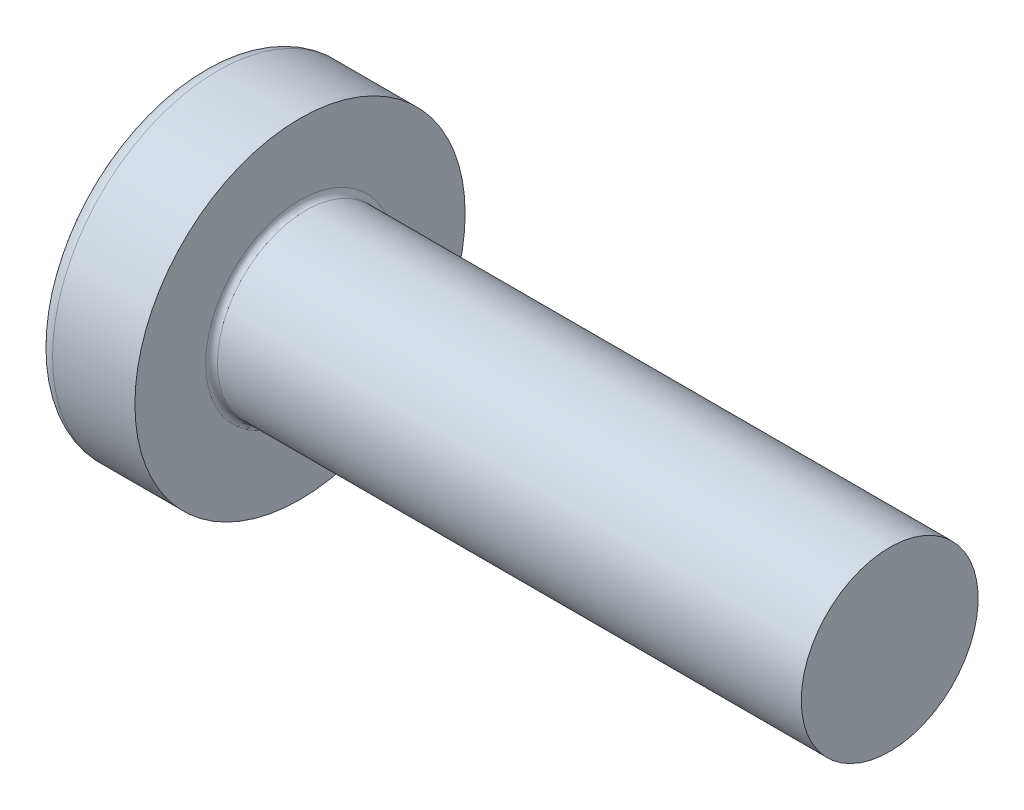
ISO-10303-21;
HEADER;
FILE_DESCRIPTION(('STEP AP214'),'2;1');
FILE_NAME('part.step','',(''),(''),'','','');
FILE_SCHEMA(('AUTOMOTIVE_DESIGN { 1 0 10303 214 1 1 1 1 }'));
ENDSEC;
DATA;
#1=APPLICATION_CONTEXT('core data for automotive mechanical design processes');
#2=APPLICATION_PROTOCOL_DEFINITION('international standard','automotive_design',2000,#1);
#3=PRODUCT_CONTEXT('',#1,'mechanical');
#4=PRODUCT('Part','Part','',(#3));
#5=PRODUCT_RELATED_PRODUCT_CATEGORY('part','',(#4));
#6=PRODUCT_DEFINITION_FORMATION('','',#4);
#7=PRODUCT_DEFINITION_CONTEXT('part definition',#1,'design');
#8=PRODUCT_DEFINITION('design','',#6,#7);
#9=PRODUCT_DEFINITION_SHAPE('','',#8);
#10=(LENGTH_UNIT() NAMED_UNIT(*) SI_UNIT(.MILLI.,.METRE.));
#11=(NAMED_UNIT(*) PLANE_ANGLE_UNIT() SI_UNIT($,.RADIAN.));
#12=(NAMED_UNIT(*) SI_UNIT($,.STERADIAN.) SOLID_ANGLE_UNIT());
#13=UNCERTAINTY_MEASURE_WITH_UNIT(LENGTH_MEASURE(1.E-05),#10,'distance_accuracy_value','');
#14=(GEOMETRIC_REPRESENTATION_CONTEXT(3) GLOBAL_UNCERTAINTY_ASSIGNED_CONTEXT((#13)) GLOBAL_UNIT_ASSIGNED_CONTEXT((#10,
#11,#12)) REPRESENTATION_CONTEXT('',''));
#15=CARTESIAN_POINT('',(0.,0.,0.));
#16=DIRECTION('',(0.,0.,1.));
#17=DIRECTION('',(1.,0.,0.));
#18=AXIS2_PLACEMENT_3D('',#15,#16,#17);
#19=CARTESIAN_POINT('',(5.,0.,0.));
#20=DIRECTION('',(-1.,0.,0.));
#21=DIRECTION('',(0.,1.,0.));
#22=AXIS2_PLACEMENT_3D('',#19,#20,#21);
#23=SPHERICAL_SURFACE('',#22,5.);
#24=CARTESIAN_POINT('',(0.775371598933733,0.,0.));
#25=DIRECTION('',(-1.,0.,0.));
#26=DIRECTION('',(0.,0.,1.));
#27=AXIS2_PLACEMENT_3D('',#24,#25,#26);
#28=CIRCLE('',#27,2.67441860465116);
#29=CARTESIAN_POINT('',(0.775371598933733,0.,2.67441860465116));
#30=VERTEX_POINT('',#29);
#31=EDGE_CURVE('E237',#30,#30,#28,.T.);
#32=ORIENTED_EDGE('',*,*,#31,.T.);
#33=EDGE_LOOP('',(#32));
#34=FACE_BOUND('',#33,.T.);
#35=CARTESIAN_POINT('',(0.0457951200896417,0.,0.));
#36=DIRECTION('',(1.,0.,0.));
#37=DIRECTION('',(0.,0.,-1.));
#38=AXIS2_PLACEMENT_3D('',#35,#36,#37);
#39=CIRCLE('',#38,0.675169614150692);
#40=CARTESIAN_POINT('',(0.0457951200896426,-0.369999999999998,-0.564760133040918));
#41=VERTEX_POINT('',#40);
#42=CARTESIAN_POINT('',(0.0457951200896417,-0.564760133040916,-0.37));
#43=VERTEX_POINT('',#42);
#44=EDGE_CURVE('E373',#41,#43,#39,.F.);
#45=ORIENTED_EDGE('',*,*,#44,.F.);
#46=CARTESIAN_POINT('',(5.,-0.37,0.));
#47=DIRECTION('',(0.,1.,0.));
#48=DIRECTION('',(0.,0.,1.));
#49=AXIS2_PLACEMENT_3D('',#46,#47,#48);
#50=CIRCLE('',#49,4.98629120689917);
#51=CARTESIAN_POINT('',(0.187869734228639,-0.369999999999995,-1.30633162146802));
#52=VERTEX_POINT('',#51);
#53=EDGE_CURVE('E299',#52,#41,#50,.T.);
#54=ORIENTED_EDGE('',*,*,#53,.F.);
#55=CARTESIAN_POINT('',(4.56358262530798,0.,0.875317983305919));
#56=DIRECTION('',(0.446197753347436,0.,-0.894934391398443));
#57=DIRECTION('',(-0.894934391398443,0.,-0.446197753347436));
#58=AXIS2_PLACEMENT_3D('',#55,#56,#57);
#59=CIRCLE('',#58,4.90340272700175);
#60=CARTESIAN_POINT('',(0.18786973422864,0.370000000000005,-1.30633162146802));
#61=VERTEX_POINT('',#60);
#62=EDGE_CURVE('E271',#52,#61,#59,.T.);
#63=ORIENTED_EDGE('',*,*,#62,.T.);
#64=CARTESIAN_POINT('',(5.,0.37,0.));
#65=DIRECTION('',(0.,-1.,0.));
#66=DIRECTION('',(0.,0.,-1.));
#67=AXIS2_PLACEMENT_3D('',#64,#65,#66);
#68=CIRCLE('',#67,4.98629120689917);
#69=CARTESIAN_POINT('',(0.0457951200896425,0.370000000000002,-0.564760133040916));
#70=VERTEX_POINT('',#69);
#71=EDGE_CURVE('E326',#70,#61,#68,.T.);
#72=ORIENTED_EDGE('',*,*,#71,.F.);
#73=CARTESIAN_POINT('',(0.0457951200896417,0.564760133040915,-0.37));
#74=VERTEX_POINT('',#73);
#75=EDGE_CURVE('E392',#74,#70,#39,.F.);
#76=ORIENTED_EDGE('',*,*,#75,.F.);
#77=CARTESIAN_POINT('',(5.,0.,-0.37));
#78=DIRECTION('',(0.,0.,1.));
#79=DIRECTION('',(1.,0.,0.));
#80=AXIS2_PLACEMENT_3D('',#77,#78,#79);
#81=CIRCLE('',#80,4.98629120689917);
#82=CARTESIAN_POINT('',(0.18786973422864,1.30633162146802,-0.37));
#83=VERTEX_POINT('',#82);
#84=EDGE_CURVE('E265',#83,#74,#81,.T.);
#85=ORIENTED_EDGE('',*,*,#84,.F.);
#86=CARTESIAN_POINT('',(4.56358262530798,-0.87531798330592,0.));
#87=DIRECTION('',(0.446197753347436,0.894934391398443,0.));
#88=DIRECTION('',(-0.894934391398442,0.446197753347436,0.));
#89=AXIS2_PLACEMENT_3D('',#86,#87,#88);
#90=CIRCLE('',#89,4.90340272700175);
#91=CARTESIAN_POINT('',(0.18786973422864,1.30633162146802,0.37));
#92=VERTEX_POINT('',#91);
#93=EDGE_CURVE('E268',#83,#92,#90,.T.);
#94=ORIENTED_EDGE('',*,*,#93,.T.);
#95=CARTESIAN_POINT('',(5.,0.,0.37));
#96=DIRECTION('',(0.,0.,-1.));
#97=DIRECTION('',(0.,1.,0.));
#98=AXIS2_PLACEMENT_3D('',#95,#96,#97);
#99=CIRCLE('',#98,4.98629120689917);
#100=CARTESIAN_POINT('',(0.0457951200896417,0.564760133040915,0.37));
#101=VERTEX_POINT('',#100);
#102=EDGE_CURVE('E261',#101,#92,#99,.T.);
#103=ORIENTED_EDGE('',*,*,#102,.F.);
#104=CARTESIAN_POINT('',(0.0457951200896434,0.369999999999998,0.564760133040918));
#105=VERTEX_POINT('',#104);
#106=EDGE_CURVE('E391',#105,#101,#39,.F.);
#107=ORIENTED_EDGE('',*,*,#106,.F.);
#108=CARTESIAN_POINT('',(0.18786973422864,0.369999999999995,1.30633162146802));
#109=VERTEX_POINT('',#108);
#110=EDGE_CURVE('E281',#109,#105,#68,.T.);
#111=ORIENTED_EDGE('',*,*,#110,.F.);
#112=CARTESIAN_POINT('',(4.56358262530798,0.,-0.87531798330592));
#113=DIRECTION('',(0.446197753347436,0.,0.894934391398443));
#114=DIRECTION('',(0.894934391398442,0.,-0.446197753347436));
#115=AXIS2_PLACEMENT_3D('',#112,#113,#114);
#116=CIRCLE('',#115,4.90340272700175);
#117=CARTESIAN_POINT('',(0.18786973422864,-0.370000000000005,1.30633162146802));
#118=VERTEX_POINT('',#117);
#119=EDGE_CURVE('E48',#109,#118,#116,.T.);
#120=ORIENTED_EDGE('',*,*,#119,.T.);
#121=CARTESIAN_POINT('',(0.0457951200896421,-0.370000000000002,0.564760133040916));
#122=VERTEX_POINT('',#121);
#123=EDGE_CURVE('E278',#122,#118,#50,.T.);
#124=ORIENTED_EDGE('',*,*,#123,.F.);
#125=CARTESIAN_POINT('',(0.0457951200896417,-0.564760133040916,0.37));
#126=VERTEX_POINT('',#125);
#127=EDGE_CURVE('E431',#126,#122,#39,.F.);
#128=ORIENTED_EDGE('',*,*,#127,.F.);
#129=CARTESIAN_POINT('',(0.187869734228638,-1.30633162146802,0.37));
#130=VERTEX_POINT('',#129);
#131=EDGE_CURVE('E262',#130,#126,#99,.T.);
#132=ORIENTED_EDGE('',*,*,#131,.F.);
#133=CARTESIAN_POINT('',(4.56358262530798,0.875317983305919,0.));
#134=DIRECTION('',(0.446197753347436,-0.894934391398443,0.));
#135=DIRECTION('',(0.894934391398443,0.446197753347436,0.));
#136=AXIS2_PLACEMENT_3D('',#133,#134,#135);
#137=CIRCLE('',#136,4.90340272700175);
#138=CARTESIAN_POINT('',(0.187869734228639,-1.30633162146802,-0.37));
#139=VERTEX_POINT('',#138);
#140=EDGE_CURVE('E258',#130,#139,#137,.T.);
#141=ORIENTED_EDGE('',*,*,#140,.T.);
#142=EDGE_CURVE('E63',#43,#139,#81,.T.);
#143=ORIENTED_EDGE('',*,*,#142,.F.);
#144=EDGE_LOOP('',(#45,#54,#63,#72,#76,#85,#94,#103,#107,#111,#120,#124,#128,#132,#141,#143));
#145=FACE_BOUND('',#144,.T.);
#146=ADVANCED_FACE('F34',(#34,#145),#23,.T.);
#147=CARTESIAN_POINT('',(1.75,0.527482331818931,-0.37));
#148=DIRECTION('',(0.,0.,1.));
#149=DIRECTION('',(1.,0.,0.));
#150=AXIS2_PLACEMENT_3D('',#147,#148,#149);
#151=PLANE('',#150);
#152=ORIENTED_EDGE('',*,*,#84,.T.);
#153=CARTESIAN_POINT('',(-0.987293237053716,0.649401255967161,-0.37));
#154=CARTESIAN_POINT('',(-0.781914975317084,0.632865887002871,-0.37));
#155=CARTESIAN_POINT('',(-0.576547882393372,0.616188977635081,-0.37));
#156=CARTESIAN_POINT('',(-0.165841599226327,0.582441031964227,-0.37));
#157=CARTESIAN_POINT('',(0.0394975903090452,0.56536998705488,-0.37));
#158=CARTESIAN_POINT('',(0.450133475422572,0.530723441326535,-0.37));
#159=CARTESIAN_POINT('',(0.655430171010573,0.513147940624557,-0.37));
#160=CARTESIAN_POINT('',(1.06596140177934,0.477314957985794,-0.37));
#161=CARTESIAN_POINT('',(1.2711959378071,0.459057485806066,-0.37));
#162=CARTESIAN_POINT('',(1.61065292365626,0.428051938688768,-0.37));
#163=CARTESIAN_POINT('',(1.74490059995643,0.415580824990931,-0.37));
#164=CARTESIAN_POINT('',(2.01334321762763,0.390092023404979,-0.37));
#165=CARTESIAN_POINT('',(2.14753815934577,0.377074339177353,-0.37));
#166=CARTESIAN_POINT('',(2.41586354151957,0.350315629452843,-0.37));
#167=CARTESIAN_POINT('',(2.5499939784531,0.33657456817765,-0.37));
#168=CARTESIAN_POINT('',(2.81814173295471,0.308004077741875,-0.37));
#169=CARTESIAN_POINT('',(2.95215904765134,0.293174621747065,-0.37));
#170=CARTESIAN_POINT('',(3.0860955068368,0.277618485071816,-0.37));
#171=B_SPLINE_CURVE_WITH_KNOTS('',3,(#153,#154,#155,#156,#157,#158,#159,#160,#161,#162,#163,
#164,#165,#166,#167,#168,#169,#170),.UNSPECIFIED.,.F.,.F.,(4,2,2,2,2,2,2,2,4),(0.,
0.618128793984691,1.23627109812525,1.85441325887562,2.4725465791681,2.87702276218609,
3.28149623678161,3.68598973550942,4.09049321032311),.UNSPECIFIED.);
#172=CARTESIAN_POINT('',(1.75,0.415013252800437,-0.370000000000001));
#173=VERTEX_POINT('',#172);
#174=EDGE_CURVE('E415',#74,#173,#171,.T.);
#175=ORIENTED_EDGE('',*,*,#174,.T.);
#176=DIRECTION('',(0.,1.,0.));
#177=VECTOR('',#176,1.);
#178=CARTESIAN_POINT('',(1.75,-0.527482331818931,-0.37));
#179=LINE('',#178,#177);
#180=CARTESIAN_POINT('',(1.75,0.527482331818931,-0.37));
#181=VERTEX_POINT('',#180);
#182=EDGE_CURVE('E355',#173,#181,#179,.T.);
#183=ORIENTED_EDGE('',*,*,#182,.T.);
#184=DIRECTION('',(0.894934391398442,-0.446197753347436,0.));
#185=VECTOR('',#184,1.);
#186=CARTESIAN_POINT('',(0.,1.4,-0.37));
#187=LINE('',#186,#185);
#188=EDGE_CURVE('E238',#83,#181,#187,.T.);
#189=ORIENTED_EDGE('',*,*,#188,.F.);
#190=EDGE_LOOP('',(#152,#175,#183,#189));
#191=FACE_BOUND('',#190,.T.);
#192=ADVANCED_FACE('F193',(#191),#151,.T.);
#193=CARTESIAN_POINT('',(1.75,-0.527482331818931,-0.37));
#194=VERTEX_POINT('',#193);
#195=CARTESIAN_POINT('',(1.75,-0.415013252800437,-0.370000000000001));
#196=VERTEX_POINT('',#195);
#197=EDGE_CURVE('E246',#194,#196,#179,.T.);
#198=ORIENTED_EDGE('',*,*,#197,.T.);
#199=CARTESIAN_POINT('',(-0.987293237053716,-0.649401255967161,-0.37));
#200=CARTESIAN_POINT('',(-0.781914975317084,-0.632865887002871,-0.37));
#201=CARTESIAN_POINT('',(-0.576547882393372,-0.616188977635081,-0.37));
#202=CARTESIAN_POINT('',(-0.165841599226327,-0.582441031964227,-0.37));
#203=CARTESIAN_POINT('',(0.0394975903090452,-0.56536998705488,-0.37));
#204=CARTESIAN_POINT('',(0.450133475422572,-0.530723441326535,-0.37));
#205=CARTESIAN_POINT('',(0.655430171010573,-0.513147940624557,-0.37));
#206=CARTESIAN_POINT('',(1.06596140177934,-0.477314957985794,-0.37));
#207=CARTESIAN_POINT('',(1.2711959378071,-0.459057485806066,-0.37));
#208=CARTESIAN_POINT('',(1.61065292365626,-0.428051938688768,-0.37));
#209=CARTESIAN_POINT('',(1.74490059995643,-0.415580824990931,-0.37));
#210=CARTESIAN_POINT('',(2.01334321762763,-0.390092023404979,-0.37));
#211=CARTESIAN_POINT('',(2.14753815934577,-0.377074339177353,-0.37));
#212=CARTESIAN_POINT('',(2.41586354151957,-0.350315629452843,-0.37));
#213=CARTESIAN_POINT('',(2.5499939784531,-0.33657456817765,-0.37));
#214=CARTESIAN_POINT('',(2.81814173295471,-0.308004077741875,-0.37));
#215=CARTESIAN_POINT('',(2.95215904765134,-0.293174621747065,-0.37));
#216=CARTESIAN_POINT('',(3.0860955068368,-0.277618485071816,-0.37));
#217=B_SPLINE_CURVE_WITH_KNOTS('',3,(#199,#200,#201,#202,#203,#204,#205,#206,#207,#208,#209,
#210,#211,#212,#213,#214,#215,#216),.UNSPECIFIED.,.F.,.F.,(4,2,2,2,2,2,2,2,4),(0.,
0.618128793984691,1.23627109812525,1.85441325887562,2.4725465791681,2.87702276218609,
3.28149623678161,3.68598973550942,4.09049321032311),.UNSPECIFIED.);
#218=EDGE_CURVE('E390',#196,#43,#217,.F.);
#219=ORIENTED_EDGE('',*,*,#218,.T.);
#220=ORIENTED_EDGE('',*,*,#142,.T.);
#221=DIRECTION('',(0.894934391398442,0.446197753347436,0.));
#222=VECTOR('',#221,1.);
#223=CARTESIAN_POINT('',(0.,-1.4,-0.37));
#224=LINE('',#223,#222);
#225=EDGE_CURVE('E329',#139,#194,#224,.T.);
#226=ORIENTED_EDGE('',*,*,#225,.T.);
#227=EDGE_LOOP('',(#198,#219,#220,#226));
#228=FACE_BOUND('',#227,.T.);
#229=ADVANCED_FACE('F199',(#228),#151,.T.);
#230=CARTESIAN_POINT('',(1.75,-0.527482331818931,0.37));
#231=DIRECTION('',(0.,0.,-1.));
#232=DIRECTION('',(0.,1.,0.));
#233=AXIS2_PLACEMENT_3D('',#230,#231,#232);
#234=PLANE('',#233);
#235=DIRECTION('',(0.,-1.,0.));
#236=VECTOR('',#235,1.);
#237=CARTESIAN_POINT('',(1.75,0.527482331818931,0.37));
#238=LINE('',#237,#236);
#239=CARTESIAN_POINT('',(1.75,0.527482331818931,0.37));
#240=VERTEX_POINT('',#239);
#241=CARTESIAN_POINT('',(1.75,0.415013252800437,0.370000000000001));
#242=VERTEX_POINT('',#241);
#243=EDGE_CURVE('E338',#240,#242,#238,.T.);
#244=ORIENTED_EDGE('',*,*,#243,.T.);
#245=CARTESIAN_POINT('',(-0.987293237053716,0.649401255967161,0.37));
#246=CARTESIAN_POINT('',(-0.781914975317084,0.632865887002871,0.37));
#247=CARTESIAN_POINT('',(-0.576547882393372,0.616188977635081,0.37));
#248=CARTESIAN_POINT('',(-0.165841599226327,0.582441031964227,0.37));
#249=CARTESIAN_POINT('',(0.0394975903090453,0.56536998705488,0.37));
#250=CARTESIAN_POINT('',(0.450133475422572,0.530723441326535,0.37));
#251=CARTESIAN_POINT('',(0.655430171010574,0.513147940624557,0.37));
#252=CARTESIAN_POINT('',(1.06596140177934,0.477314957985794,0.37));
#253=CARTESIAN_POINT('',(1.2711959378071,0.459057485806066,0.37));
#254=CARTESIAN_POINT('',(1.61065292365626,0.428051938688768,0.37));
#255=CARTESIAN_POINT('',(1.74490059995643,0.415580824990931,0.37));
#256=CARTESIAN_POINT('',(2.01334321762763,0.39009202340498,0.37));
#257=CARTESIAN_POINT('',(2.14753815934577,0.377074339177353,0.37));
#258=CARTESIAN_POINT('',(2.41586354151957,0.350315629452843,0.37));
#259=CARTESIAN_POINT('',(2.5499939784531,0.33657456817765,0.37));
#260=CARTESIAN_POINT('',(2.81814173295471,0.308004077741875,0.37));
#261=CARTESIAN_POINT('',(2.95215904765134,0.293174621747065,0.37));
#262=CARTESIAN_POINT('',(3.0860955068368,0.277618485071816,0.37));
#263=B_SPLINE_CURVE_WITH_KNOTS('',3,(#245,#246,#247,#248,#249,#250,#251,#252,#253,#254,#255,
#256,#257,#258,#259,#260,#261,#262),.UNSPECIFIED.,.F.,.F.,(4,2,2,2,2,2,2,2,4),(0.,
0.618128793984691,1.23627109812525,1.85441325887562,2.4725465791681,2.87702276218609,
3.28149623678161,3.68598973550942,4.09049321032311),.UNSPECIFIED.);
#264=EDGE_CURVE('E670',#242,#101,#263,.F.);
#265=ORIENTED_EDGE('',*,*,#264,.T.);
#266=ORIENTED_EDGE('',*,*,#102,.T.);
#267=DIRECTION('',(0.894934391398442,-0.446197753347436,0.));
#268=VECTOR('',#267,1.);
#269=CARTESIAN_POINT('',(0.,1.4,0.37));
#270=LINE('',#269,#268);
#271=EDGE_CURVE('E243',#92,#240,#270,.T.);
#272=ORIENTED_EDGE('',*,*,#271,.T.);
#273=EDGE_LOOP('',(#244,#265,#266,#272));
#274=FACE_BOUND('',#273,.T.);
#275=ADVANCED_FACE('F411',(#274),#234,.T.);
#276=ORIENTED_EDGE('',*,*,#131,.T.);
#277=CARTESIAN_POINT('',(-0.987293237069635,-0.649401255968442,0.37));
#278=CARTESIAN_POINT('',(-0.781914975331301,-0.632865887004023,0.37));
#279=CARTESIAN_POINT('',(-0.576547882405888,-0.616188977636102,0.37));
#280=CARTESIAN_POINT('',(-0.16584159923544,-0.582441031964983,0.37));
#281=CARTESIAN_POINT('',(0.0394975903016338,-0.5653699870555,0.37));
#282=CARTESIAN_POINT('',(0.450133475420601,-0.530723441326706,0.37));
#283=CARTESIAN_POINT('',(0.655430171012341,-0.513147940624409,0.37));
#284=CARTESIAN_POINT('',(1.06596140178858,-0.477314957984981,0.37));
#285=CARTESIAN_POINT('',(1.27119593782008,-0.459057485804908,0.37));
#286=CARTESIAN_POINT('',(1.61065292367297,-0.428051938687225,0.37));
#287=CARTESIAN_POINT('',(1.74490059997313,-0.415580824989368,0.37));
#288=CARTESIAN_POINT('',(2.01334321764434,-0.390092023403371,0.37));
#289=CARTESIAN_POINT('',(2.14753815936247,-0.377074339175718,0.37));
#290=CARTESIAN_POINT('',(2.41586354153627,-0.350315629451146,0.37));
#291=CARTESIAN_POINT('',(2.54999397846979,-0.336574568175918,0.37));
#292=CARTESIAN_POINT('',(2.8181417329714,-0.308004077740054,0.37));
#293=CARTESIAN_POINT('',(2.95215904766802,-0.29317462174519,0.37));
#294=CARTESIAN_POINT('',(3.08609550685347,-0.277618485069873,0.37));
#295=B_SPLINE_CURVE_WITH_KNOTS('',3,(#277,#278,#279,#280,#281,#282,#283,#284,#285,#286,#287,
#288,#289,#290,#291,#292,#293,#294),.UNSPECIFIED.,.F.,.F.,(4,2,2,2,2,2,2,2,4),(0.,
0.61812879398981,1.23627109813549,1.85441325889711,2.47254657920086,2.87702276221884,
3.28149623681437,3.68598973554218,4.09049321035586),.UNSPECIFIED.);
#296=CARTESIAN_POINT('',(1.75,-0.415013252800437,0.37));
#297=VERTEX_POINT('',#296);
#298=EDGE_CURVE('E432',#126,#297,#295,.T.);
#299=ORIENTED_EDGE('',*,*,#298,.T.);
#300=CARTESIAN_POINT('',(1.75,-0.527482331818932,0.37));
#301=VERTEX_POINT('',#300);
#302=EDGE_CURVE('E340',#297,#301,#238,.T.);
#303=ORIENTED_EDGE('',*,*,#302,.T.);
#304=DIRECTION('',(0.894934391398443,0.446197753347436,0.));
#305=VECTOR('',#304,1.);
#306=CARTESIAN_POINT('',(0.,-1.4,0.37));
#307=LINE('',#306,#305);
#308=EDGE_CURVE('E331',#130,#301,#307,.T.);
#309=ORIENTED_EDGE('',*,*,#308,.F.);
#310=EDGE_LOOP('',(#276,#299,#303,#309));
#311=FACE_BOUND('',#310,.T.);
#312=ADVANCED_FACE('F518',(#311),#234,.T.);
#313=CARTESIAN_POINT('',(1.75,0.527482331818931,0.37));
#314=DIRECTION('',(0.446197753347436,0.894934391398443,0.));
#315=DIRECTION('',(-0.894934391398442,0.446197753347436,0.));
#316=AXIS2_PLACEMENT_3D('',#313,#314,#315);
#317=PLANE('',#316);
#318=CARTESIAN_POINT('',(2.6696526882832,0.0689604923233249,0.));
#319=DIRECTION('',(0.446197753347436,0.894934391398443,0.));
#320=DIRECTION('',(-0.894934391398443,0.446197753347436,0.));
#321=AXIS2_PLACEMENT_3D('',#318,#319,#320);
#322=ELLIPSE('',#321,1.10195897609154,0.486831694838766);
#323=CARTESIAN_POINT('',(1.75,0.527482331818932,0.175779377683682));
#324=VERTEX_POINT('',#323);
#325=CARTESIAN_POINT('',(1.75,0.527482331818932,-0.175779377683682));
#326=VERTEX_POINT('',#325);
#327=EDGE_CURVE('E304',#324,#326,#322,.F.);
#328=ORIENTED_EDGE('',*,*,#327,.F.);
#329=DIRECTION('',(0.,0.,-1.));
#330=VECTOR('',#329,1.);
#331=CARTESIAN_POINT('',(1.75,0.527482331818931,0.37));
#332=LINE('',#331,#330);
#333=EDGE_CURVE('E341',#240,#324,#332,.T.);
#334=ORIENTED_EDGE('',*,*,#333,.F.);
#335=ORIENTED_EDGE('',*,*,#271,.F.);
#336=ORIENTED_EDGE('',*,*,#93,.F.);
#337=ORIENTED_EDGE('',*,*,#188,.T.);
#338=EDGE_CURVE('E343',#326,#181,#332,.T.);
#339=ORIENTED_EDGE('',*,*,#338,.F.);
#340=EDGE_LOOP('',(#328,#334,#335,#336,#337,#339));
#341=FACE_BOUND('',#340,.T.);
#342=ADVANCED_FACE('F409',(#341),#317,.F.);
#343=CARTESIAN_POINT('',(0.,-1.4,-0.37));
#344=DIRECTION('',(0.446197753347436,-0.894934391398443,0.));
#345=DIRECTION('',(0.894934391398443,0.446197753347436,0.));
#346=AXIS2_PLACEMENT_3D('',#343,#344,#345);
#347=PLANE('',#346);
#348=CARTESIAN_POINT('',(2.6696526882832,-0.0689604923233252,0.));
#349=DIRECTION('',(0.446197753347436,-0.894934391398443,0.));
#350=DIRECTION('',(-0.894934391398443,-0.446197753347436,0.));
#351=AXIS2_PLACEMENT_3D('',#348,#349,#350);
#352=ELLIPSE('',#351,1.10195897609154,0.486831694838766);
#353=CARTESIAN_POINT('',(1.75,-0.527482331818932,-0.175779377683681));
#354=VERTEX_POINT('',#353);
#355=CARTESIAN_POINT('',(1.75,-0.527482331818932,0.17577937768368));
#356=VERTEX_POINT('',#355);
#357=EDGE_CURVE('E672',#354,#356,#352,.F.);
#358=ORIENTED_EDGE('',*,*,#357,.F.);
#359=DIRECTION('',(0.,0.,1.));
#360=VECTOR('',#359,1.);
#361=CARTESIAN_POINT('',(1.75,-0.527482331818931,-0.37));
#362=LINE('',#361,#360);
#363=EDGE_CURVE('E334',#194,#354,#362,.T.);
#364=ORIENTED_EDGE('',*,*,#363,.F.);
#365=ORIENTED_EDGE('',*,*,#225,.F.);
#366=ORIENTED_EDGE('',*,*,#140,.F.);
#367=ORIENTED_EDGE('',*,*,#308,.T.);
#368=EDGE_CURVE('E337',#356,#301,#362,.T.);
#369=ORIENTED_EDGE('',*,*,#368,.F.);
#370=EDGE_LOOP('',(#358,#364,#365,#366,#367,#369));
#371=FACE_BOUND('',#370,.T.);
#372=ADVANCED_FACE('F505',(#371),#347,.F.);
#373=CARTESIAN_POINT('',(1.75,0.527482331818931,-0.37));
#374=DIRECTION('',(-1.,0.,0.));
#375=DIRECTION('',(0.,0.,1.));
#376=AXIS2_PLACEMENT_3D('',#373,#374,#375);
#377=PLANE('',#376);
#378=DIRECTION('',(0.,1.,0.));
#379=VECTOR('',#378,1.);
#380=CARTESIAN_POINT('',(1.75,-0.370000000000002,0.52748233181893));
#381=LINE('',#380,#379);
#382=CARTESIAN_POINT('',(1.75,-0.370000000000002,0.52748233181893));
#383=VERTEX_POINT('',#382);
#384=CARTESIAN_POINT('',(1.75,-0.175779377683686,0.52748233181893));
#385=VERTEX_POINT('',#384);
#386=EDGE_CURVE('E319',#383,#385,#381,.T.);
#387=ORIENTED_EDGE('',*,*,#386,.T.);
#388=CARTESIAN_POINT('',(1.75,0.,0.));
#389=DIRECTION('',(-1.,0.,0.));
#390=DIRECTION('',(0.,0.,1.));
#391=AXIS2_PLACEMENT_3D('',#388,#389,#390);
#392=CIRCLE('',#391,0.556);
#393=CARTESIAN_POINT('',(1.75,-0.370000000000001,0.415013252800436));
#394=VERTEX_POINT('',#393);
#395=EDGE_CURVE('E700',#394,#385,#392,.T.);
#396=ORIENTED_EDGE('',*,*,#395,.F.);
#397=DIRECTION('',(0.,0.,-1.));
#398=VECTOR('',#397,1.);
#399=CARTESIAN_POINT('',(1.75,-0.370000000000002,0.52748233181893));
#400=LINE('',#399,#398);
#401=EDGE_CURVE('E315',#383,#394,#400,.T.);
#402=ORIENTED_EDGE('',*,*,#401,.F.);
#403=EDGE_LOOP('',(#387,#396,#402));
#404=FACE_BOUND('',#403,.T.);
#405=ADVANCED_FACE('F498',(#404),#377,.T.);
#406=ORIENTED_EDGE('',*,*,#302,.F.);
#407=EDGE_CURVE('E705',#356,#297,#392,.T.);
#408=ORIENTED_EDGE('',*,*,#407,.F.);
#409=ORIENTED_EDGE('',*,*,#368,.T.);
#410=EDGE_LOOP('',(#406,#408,#409));
#411=FACE_BOUND('',#410,.T.);
#412=ADVANCED_FACE('F491',(#411),#377,.T.);
#413=ORIENTED_EDGE('',*,*,#363,.T.);
#414=EDGE_CURVE('E384',#196,#354,#392,.T.);
#415=ORIENTED_EDGE('',*,*,#414,.F.);
#416=ORIENTED_EDGE('',*,*,#197,.F.);
#417=EDGE_LOOP('',(#413,#415,#416));
#418=FACE_BOUND('',#417,.T.);
#419=ADVANCED_FACE('F485',(#418),#377,.T.);
#420=CARTESIAN_POINT('',(1.75,-0.369999999999998,-0.415013252800438));
#421=VERTEX_POINT('',#420);
#422=CARTESIAN_POINT('',(1.75,-0.369999999999998,-0.527482331818933));
#423=VERTEX_POINT('',#422);
#424=EDGE_CURVE('E318',#421,#423,#400,.T.);
#425=ORIENTED_EDGE('',*,*,#424,.F.);
#426=CARTESIAN_POINT('',(1.75,-0.17577937768368,-0.527482331818932));
#427=VERTEX_POINT('',#426);
#428=EDGE_CURVE('E55',#427,#421,#392,.T.);
#429=ORIENTED_EDGE('',*,*,#428,.F.);
#430=DIRECTION('',(0.,-1.,0.));
#431=VECTOR('',#430,1.);
#432=CARTESIAN_POINT('',(1.75,0.370000000000002,-0.52748233181893));
#433=LINE('',#432,#431);
#434=EDGE_CURVE('E314',#427,#423,#433,.T.);
#435=ORIENTED_EDGE('',*,*,#434,.T.);
#436=EDGE_LOOP('',(#425,#429,#435));
#437=FACE_BOUND('',#436,.T.);
#438=ADVANCED_FACE('F379',(#437),#377,.T.);
#439=CARTESIAN_POINT('',(1.75,0.370000000000002,-0.52748233181893));
#440=VERTEX_POINT('',#439);
#441=CARTESIAN_POINT('',(1.75,0.175779377683684,-0.527482331818931));
#442=VERTEX_POINT('',#441);
#443=EDGE_CURVE('E311',#440,#442,#433,.T.);
#444=ORIENTED_EDGE('',*,*,#443,.T.);
#445=CARTESIAN_POINT('',(1.75,0.370000000000001,-0.415013252800436));
#446=VERTEX_POINT('',#445);
#447=EDGE_CURVE('E383',#446,#442,#392,.T.);
#448=ORIENTED_EDGE('',*,*,#447,.F.);
#449=DIRECTION('',(0.,0.,1.));
#450=VECTOR('',#449,1.);
#451=CARTESIAN_POINT('',(1.75,0.370000000000002,-0.52748233181893));
#452=LINE('',#451,#450);
#453=EDGE_CURVE('E323',#440,#446,#452,.T.);
#454=ORIENTED_EDGE('',*,*,#453,.F.);
#455=EDGE_LOOP('',(#444,#448,#454));
#456=FACE_BOUND('',#455,.T.);
#457=ADVANCED_FACE('F473',(#456),#377,.T.);
#458=ORIENTED_EDGE('',*,*,#182,.F.);
#459=EDGE_CURVE('E689',#326,#173,#392,.T.);
#460=ORIENTED_EDGE('',*,*,#459,.F.);
#461=ORIENTED_EDGE('',*,*,#338,.T.);
#462=EDGE_LOOP('',(#458,#460,#461));
#463=FACE_BOUND('',#462,.T.);
#464=ADVANCED_FACE('F466',(#463),#377,.T.);
#465=ORIENTED_EDGE('',*,*,#333,.T.);
#466=EDGE_CURVE('E691',#242,#324,#392,.T.);
#467=ORIENTED_EDGE('',*,*,#466,.F.);
#468=ORIENTED_EDGE('',*,*,#243,.F.);
#469=EDGE_LOOP('',(#465,#467,#468));
#470=FACE_BOUND('',#469,.T.);
#471=ADVANCED_FACE('F460',(#470),#377,.T.);
#472=CARTESIAN_POINT('',(1.75,0.369999999999998,0.527482331818932));
#473=DIRECTION('',(0.,-1.,0.));
#474=DIRECTION('',(1.,0.,0.));
#475=AXIS2_PLACEMENT_3D('',#472,#473,#474);
#476=PLANE('',#475);
#477=ORIENTED_EDGE('',*,*,#110,.T.);
#478=CARTESIAN_POINT('',(-0.987293237069635,0.369999999999998,0.649401255968443));
#479=CARTESIAN_POINT('',(-0.781914975331301,0.369999999999998,0.632865887004024));
#480=CARTESIAN_POINT('',(-0.576547882405888,0.369999999999998,0.616188977636103));
#481=CARTESIAN_POINT('',(-0.16584159923544,0.369999999999998,0.582441031964984));
#482=CARTESIAN_POINT('',(0.0394975903016338,0.369999999999998,0.565369987055501));
#483=CARTESIAN_POINT('',(0.450133475420601,0.369999999999998,0.530723441326707));
#484=CARTESIAN_POINT('',(0.655430171012341,0.369999999999998,0.51314794062441));
#485=CARTESIAN_POINT('',(1.06596140178858,0.369999999999998,0.477314957984982));
#486=CARTESIAN_POINT('',(1.27119593782008,0.369999999999998,0.459057485804909));
#487=CARTESIAN_POINT('',(1.61065292367297,0.369999999999999,0.428051938687226));
#488=CARTESIAN_POINT('',(1.74490059997313,0.369999999999999,0.415580824989369));
#489=CARTESIAN_POINT('',(2.01334321764434,0.369999999999999,0.390092023403372));
#490=CARTESIAN_POINT('',(2.14753815936247,0.369999999999999,0.37707433917572));
#491=CARTESIAN_POINT('',(2.41586354153627,0.369999999999999,0.350315629451147));
#492=CARTESIAN_POINT('',(2.54999397846979,0.369999999999999,0.336574568175919));
#493=CARTESIAN_POINT('',(2.8181417329714,0.369999999999999,0.308004077740055));
#494=CARTESIAN_POINT('',(2.95215904766802,0.369999999999999,0.293174621745191));
#495=CARTESIAN_POINT('',(3.08609550685347,0.369999999999999,0.277618485069875));
#496=B_SPLINE_CURVE_WITH_KNOTS('',3,(#478,#479,#480,#481,#482,#483,#484,#485,#486,#487,#488,
#489,#490,#491,#492,#493,#494,#495),.UNSPECIFIED.,.F.,.F.,(4,2,2,2,2,2,2,2,4),(0.,
0.61812879398981,1.23627109813549,1.85441325889711,2.47254657920086,2.87702276221884,
3.28149623681436,3.68598973554218,4.09049321035586),.UNSPECIFIED.);
#497=CARTESIAN_POINT('',(1.75,0.369999999999999,0.415013252800439));
#498=VERTEX_POINT('',#497);
#499=EDGE_CURVE('E669',#105,#498,#496,.T.);
#500=ORIENTED_EDGE('',*,*,#499,.T.);
#501=CARTESIAN_POINT('',(1.75,0.369999999999998,0.527482331818932));
#502=VERTEX_POINT('',#501);
#503=EDGE_CURVE('E296',#498,#502,#452,.T.);
#504=ORIENTED_EDGE('',*,*,#503,.T.);
#505=DIRECTION('',(0.894934391398442,0.,-0.446197753347436));
#506=VECTOR('',#505,1.);
#507=CARTESIAN_POINT('',(0.,0.369999999999995,1.4));
#508=LINE('',#507,#506);
#509=EDGE_CURVE('E289',#109,#502,#508,.T.);
#510=ORIENTED_EDGE('',*,*,#509,.F.);
#511=EDGE_LOOP('',(#477,#500,#504,#510));
#512=FACE_BOUND('',#511,.T.);
#513=ADVANCED_FACE('F293',(#512),#476,.T.);
#514=CARTESIAN_POINT('',(1.75,-0.369999999999998,-0.527482331818933));
#515=DIRECTION('',(0.,1.,0.));
#516=DIRECTION('',(0.,0.,1.));
#517=AXIS2_PLACEMENT_3D('',#514,#515,#516);
#518=PLANE('',#517);
#519=ORIENTED_EDGE('',*,*,#401,.T.);
#520=CARTESIAN_POINT('',(-0.987293237053716,-0.370000000000002,0.64940125596716));
#521=CARTESIAN_POINT('',(-0.781914975317084,-0.370000000000002,0.63286588700287));
#522=CARTESIAN_POINT('',(-0.576547882393372,-0.370000000000002,0.61618897763508));
#523=CARTESIAN_POINT('',(-0.165841599226327,-0.370000000000002,0.582441031964225));
#524=CARTESIAN_POINT('',(0.0394975903090451,-0.370000000000002,0.565369987054878));
#525=CARTESIAN_POINT('',(0.450133475422572,-0.370000000000002,0.530723441326533));
#526=CARTESIAN_POINT('',(0.655430171010573,-0.370000000000002,0.513147940624555));
#527=CARTESIAN_POINT('',(1.06596140177934,-0.370000000000002,0.477314957985793));
#528=CARTESIAN_POINT('',(1.2711959378071,-0.370000000000002,0.459057485806065));
#529=CARTESIAN_POINT('',(1.61065292365626,-0.370000000000001,0.428051938688767));
#530=CARTESIAN_POINT('',(1.74490059995642,-0.370000000000001,0.41558082499093));
#531=CARTESIAN_POINT('',(2.01334321762763,-0.370000000000001,0.390092023404978));
#532=CARTESIAN_POINT('',(2.14753815934577,-0.370000000000001,0.377074339177352));
#533=CARTESIAN_POINT('',(2.41586354151957,-0.370000000000001,0.350315629452841));
#534=CARTESIAN_POINT('',(2.5499939784531,-0.370000000000001,0.336574568177649));
#535=CARTESIAN_POINT('',(2.81814173295471,-0.370000000000001,0.308004077741874));
#536=CARTESIAN_POINT('',(2.95215904765134,-0.370000000000001,0.293174621747063));
#537=CARTESIAN_POINT('',(3.0860955068368,-0.370000000000001,0.277618485071814));
#538=B_SPLINE_CURVE_WITH_KNOTS('',3,(#520,#521,#522,#523,#524,#525,#526,#527,#528,#529,#530,
#531,#532,#533,#534,#535,#536,#537),.UNSPECIFIED.,.F.,.F.,(4,2,2,2,2,2,2,2,4),(0.,
0.618128793984691,1.23627109812525,1.85441325887562,2.4725465791681,2.87702276218609,
3.28149623678161,3.68598973550942,4.09049321032311),.UNSPECIFIED.);
#539=EDGE_CURVE('E424',#394,#122,#538,.F.);
#540=ORIENTED_EDGE('',*,*,#539,.T.);
#541=ORIENTED_EDGE('',*,*,#123,.T.);
#542=DIRECTION('',(0.894934391398442,0.,-0.446197753347436));
#543=VECTOR('',#542,1.);
#544=CARTESIAN_POINT('',(0.,-0.370000000000005,1.4));
#545=LINE('',#544,#543);
#546=EDGE_CURVE('E291',#118,#383,#545,.T.);
#547=ORIENTED_EDGE('',*,*,#546,.T.);
#548=EDGE_LOOP('',(#519,#540,#541,#547));
#549=FACE_BOUND('',#548,.T.);
#550=ADVANCED_FACE('F228',(#549),#518,.T.);
#551=CARTESIAN_POINT('',(1.75,-0.370000000000002,0.52748233181893));
#552=DIRECTION('',(0.446197753347436,0.,0.894934391398443));
#553=DIRECTION('',(-0.894934391398442,0.,0.446197753347436));
#554=AXIS2_PLACEMENT_3D('',#551,#552,#553);
#555=PLANE('',#554);
#556=CARTESIAN_POINT('',(2.6696526882832,0.,0.0689604923233248));
#557=DIRECTION('',(0.446197753347436,0.,0.894934391398443));
#558=DIRECTION('',(-0.894934391398443,0.,0.446197753347436));
#559=AXIS2_PLACEMENT_3D('',#556,#557,#558);
#560=ELLIPSE('',#559,1.10195897609154,0.486831694838766);
#561=CARTESIAN_POINT('',(1.75,0.175779377683682,0.527482331818932));
#562=VERTEX_POINT('',#561);
#563=EDGE_CURVE('E422',#385,#562,#560,.F.);
#564=ORIENTED_EDGE('',*,*,#563,.F.);
#565=ORIENTED_EDGE('',*,*,#386,.F.);
#566=ORIENTED_EDGE('',*,*,#546,.F.);
#567=ORIENTED_EDGE('',*,*,#119,.F.);
#568=ORIENTED_EDGE('',*,*,#509,.T.);
#569=EDGE_CURVE('E322',#562,#502,#381,.T.);
#570=ORIENTED_EDGE('',*,*,#569,.F.);
#571=EDGE_LOOP('',(#564,#565,#566,#567,#568,#570));
#572=FACE_BOUND('',#571,.T.);
#573=ADVANCED_FACE('F287',(#572),#555,.F.);
#574=CARTESIAN_POINT('',(0.,0.370000000000005,-1.4));
#575=DIRECTION('',(0.446197753347436,0.,-0.894934391398443));
#576=DIRECTION('',(0.894934391398443,0.,0.446197753347436));
#577=AXIS2_PLACEMENT_3D('',#574,#575,#576);
#578=PLANE('',#577);
#579=CARTESIAN_POINT('',(2.6696526882832,0.,-0.0689604923233253));
#580=DIRECTION('',(0.446197753347436,0.,-0.894934391398443));
#581=DIRECTION('',(-0.894934391398443,0.,-0.446197753347436));
#582=AXIS2_PLACEMENT_3D('',#579,#580,#581);
#583=ELLIPSE('',#582,1.10195897609154,0.486831694838766);
#584=EDGE_CURVE('E377',#442,#427,#583,.F.);
#585=ORIENTED_EDGE('',*,*,#584,.F.);
#586=ORIENTED_EDGE('',*,*,#443,.F.);
#587=DIRECTION('',(0.894934391398442,0.,0.446197753347436));
#588=VECTOR('',#587,1.);
#589=CARTESIAN_POINT('',(0.,0.370000000000005,-1.4));
#590=LINE('',#589,#588);
#591=EDGE_CURVE('E301',#61,#440,#590,.T.);
#592=ORIENTED_EDGE('',*,*,#591,.F.);
#593=ORIENTED_EDGE('',*,*,#62,.F.);
#594=DIRECTION('',(0.894934391398443,0.,0.446197753347436));
#595=VECTOR('',#594,1.);
#596=CARTESIAN_POINT('',(0.,-0.369999999999995,-1.4));
#597=LINE('',#596,#595);
#598=EDGE_CURVE('E308',#52,#423,#597,.T.);
#599=ORIENTED_EDGE('',*,*,#598,.T.);
#600=ORIENTED_EDGE('',*,*,#434,.F.);
#601=EDGE_LOOP('',(#585,#586,#592,#593,#599,#600));
#602=FACE_BOUND('',#601,.T.);
#603=ADVANCED_FACE('F368',(#602),#578,.F.);
#604=ORIENTED_EDGE('',*,*,#453,.T.);
#605=CARTESIAN_POINT('',(-0.987293237053716,0.370000000000002,-0.649401255967159));
#606=CARTESIAN_POINT('',(-0.781914975317084,0.370000000000002,-0.63286588700287));
#607=CARTESIAN_POINT('',(-0.576547882393372,0.370000000000002,-0.61618897763508));
#608=CARTESIAN_POINT('',(-0.165841599226327,0.370000000000002,-0.582441031964225));
#609=CARTESIAN_POINT('',(0.039497590309045,0.370000000000002,-0.565369987054878));
#610=CARTESIAN_POINT('',(0.450133475422572,0.370000000000002,-0.530723441326533));
#611=CARTESIAN_POINT('',(0.655430171010573,0.370000000000002,-0.513147940624555));
#612=CARTESIAN_POINT('',(1.06596140177934,0.370000000000002,-0.477314957985793));
#613=CARTESIAN_POINT('',(1.2711959378071,0.370000000000002,-0.459057485806065));
#614=CARTESIAN_POINT('',(1.61065292365626,0.370000000000001,-0.428051938688767));
#615=CARTESIAN_POINT('',(1.74490059995642,0.370000000000001,-0.41558082499093));
#616=CARTESIAN_POINT('',(2.01334321762763,0.370000000000001,-0.390092023404978));
#617=CARTESIAN_POINT('',(2.14753815934577,0.370000000000001,-0.377074339177352));
#618=CARTESIAN_POINT('',(2.41586354151957,0.370000000000001,-0.350315629452841));
#619=CARTESIAN_POINT('',(2.5499939784531,0.370000000000001,-0.336574568177649));
#620=CARTESIAN_POINT('',(2.81814173295471,0.370000000000001,-0.308004077741874));
#621=CARTESIAN_POINT('',(2.95215904765134,0.370000000000001,-0.293174621747064));
#622=CARTESIAN_POINT('',(3.0860955068368,0.370000000000001,-0.277618485071814));
#623=B_SPLINE_CURVE_WITH_KNOTS('',3,(#605,#606,#607,#608,#609,#610,#611,#612,#613,#614,#615,
#616,#617,#618,#619,#620,#621,#622),.UNSPECIFIED.,.F.,.F.,(4,2,2,2,2,2,2,2,4),(0.,
0.618128793984691,1.23627109812525,1.85441325887562,2.4725465791681,2.87702276218609,
3.28149623678161,3.68598973550942,4.09049321032311),.UNSPECIFIED.);
#624=EDGE_CURVE('E364',#446,#70,#623,.F.);
#625=ORIENTED_EDGE('',*,*,#624,.T.);
#626=ORIENTED_EDGE('',*,*,#71,.T.);
#627=ORIENTED_EDGE('',*,*,#591,.T.);
#628=EDGE_LOOP('',(#604,#625,#626,#627));
#629=FACE_BOUND('',#628,.T.);
#630=ADVANCED_FACE('F226',(#629),#476,.T.);
#631=ORIENTED_EDGE('',*,*,#53,.T.);
#632=CARTESIAN_POINT('',(-0.987293237069635,-0.369999999999997,-0.649401255968443));
#633=CARTESIAN_POINT('',(-0.781914975331301,-0.369999999999997,-0.632865887004025));
#634=CARTESIAN_POINT('',(-0.576547882405888,-0.369999999999997,-0.616188977636104));
#635=CARTESIAN_POINT('',(-0.16584159923544,-0.369999999999998,-0.582441031964984));
#636=CARTESIAN_POINT('',(0.0394975903016337,-0.369999999999998,-0.565369987055501));
#637=CARTESIAN_POINT('',(0.450133475420601,-0.369999999999998,-0.530723441326707));
#638=CARTESIAN_POINT('',(0.655430171012341,-0.369999999999998,-0.51314794062441));
#639=CARTESIAN_POINT('',(1.06596140178858,-0.369999999999998,-0.477314957984982));
#640=CARTESIAN_POINT('',(1.27119593782008,-0.369999999999998,-0.459057485804909));
#641=CARTESIAN_POINT('',(1.61065292367297,-0.369999999999998,-0.428051938687226));
#642=CARTESIAN_POINT('',(1.74490059997313,-0.369999999999998,-0.415580824989369));
#643=CARTESIAN_POINT('',(2.01334321764434,-0.369999999999999,-0.390092023403372));
#644=CARTESIAN_POINT('',(2.14753815936247,-0.369999999999999,-0.37707433917572));
#645=CARTESIAN_POINT('',(2.41586354153627,-0.369999999999999,-0.350315629451147));
#646=CARTESIAN_POINT('',(2.54999397846979,-0.369999999999999,-0.336574568175919));
#647=CARTESIAN_POINT('',(2.8181417329714,-0.369999999999999,-0.308004077740055));
#648=CARTESIAN_POINT('',(2.95215904766802,-0.369999999999999,-0.293174621745191));
#649=CARTESIAN_POINT('',(3.08609550685347,-0.369999999999999,-0.277618485069875));
#650=B_SPLINE_CURVE_WITH_KNOTS('',3,(#632,#633,#634,#635,#636,#637,#638,#639,#640,#641,#642,
#643,#644,#645,#646,#647,#648,#649),.UNSPECIFIED.,.F.,.F.,(4,2,2,2,2,2,2,2,4),(0.,
0.61812879398981,1.23627109813549,1.85441325889711,2.47254657920086,2.87702276221884,
3.28149623681436,3.68598973554218,4.09049321035586),.UNSPECIFIED.);
#651=EDGE_CURVE('E11',#41,#421,#650,.T.);
#652=ORIENTED_EDGE('',*,*,#651,.T.);
#653=ORIENTED_EDGE('',*,*,#424,.T.);
#654=ORIENTED_EDGE('',*,*,#598,.F.);
#655=EDGE_LOOP('',(#631,#652,#653,#654));
#656=FACE_BOUND('',#655,.T.);
#657=ADVANCED_FACE('F221',(#656),#518,.T.);
#658=CARTESIAN_POINT('',(-25.4,0.,0.));
#659=DIRECTION('',(-1.,0.,0.));
#660=DIRECTION('',(0.,0.,1.));
#661=AXIS2_PLACEMENT_3D('',#658,#659,#660);
#662=CYLINDRICAL_SURFACE('',#661,1.5);
#663=CARTESIAN_POINT('',(2.5,0.,0.));
#664=DIRECTION('',(-1.,0.,0.));
#665=DIRECTION('',(0.,0.,1.));
#666=AXIS2_PLACEMENT_3D('',#663,#664,#665);
#667=CIRCLE('',#666,1.5);
#668=CARTESIAN_POINT('',(2.5,0.,1.5));
#669=VERTEX_POINT('',#668);
#670=EDGE_CURVE('E232',#669,#669,#667,.F.);
#671=ORIENTED_EDGE('',*,*,#670,.T.);
#672=EDGE_LOOP('',(#671));
#673=FACE_BOUND('',#672,.T.);
#674=CARTESIAN_POINT('',(12.4,0.,0.));
#675=DIRECTION('',(-1.,0.,0.));
#676=DIRECTION('',(0.,0.,1.));
#677=AXIS2_PLACEMENT_3D('',#674,#675,#676);
#678=CIRCLE('',#677,1.5);
#679=CARTESIAN_POINT('',(12.4,0.,1.5));
#680=VERTEX_POINT('',#679);
#681=EDGE_CURVE('E235',#680,#680,#678,.T.);
#682=ORIENTED_EDGE('',*,*,#681,.T.);
#683=EDGE_LOOP('',(#682));
#684=FACE_BOUND('',#683,.T.);
#685=ADVANCED_FACE('F218',(#673,#684),#662,.T.);
#686=CARTESIAN_POINT('',(2.4,1.5,0.));
#687=DIRECTION('',(-1.,0.,0.));
#688=DIRECTION('',(0.,0.,1.));
#689=AXIS2_PLACEMENT_3D('',#686,#687,#688);
#690=PLANE('',#689);
#691=CARTESIAN_POINT('',(2.4,0.,0.));
#692=DIRECTION('',(-1.,0.,0.));
#693=DIRECTION('',(0.,0.,1.));
#694=AXIS2_PLACEMENT_3D('',#691,#692,#693);
#695=CIRCLE('',#694,1.6);
#696=CARTESIAN_POINT('',(2.4,0.,1.6));
#697=VERTEX_POINT('',#696);
#698=EDGE_CURVE('E254',#697,#697,#695,.T.);
#699=ORIENTED_EDGE('',*,*,#698,.T.);
#700=EDGE_LOOP('',(#699));
#701=FACE_BOUND('',#700,.T.);
#702=CARTESIAN_POINT('',(2.4,0.,0.));
#703=DIRECTION('',(-1.,0.,0.));
#704=DIRECTION('',(0.,0.,1.));
#705=AXIS2_PLACEMENT_3D('',#702,#703,#704);
#706=CIRCLE('',#705,2.8);
#707=CARTESIAN_POINT('',(2.4,0.,2.8));
#708=VERTEX_POINT('',#707);
#709=EDGE_CURVE('E251',#708,#708,#706,.T.);
#710=ORIENTED_EDGE('',*,*,#709,.F.);
#711=EDGE_LOOP('',(#710));
#712=FACE_BOUND('',#711,.T.);
#713=ADVANCED_FACE('F215',(#701,#712),#690,.F.);
#714=CARTESIAN_POINT('',(-25.4,0.,0.));
#715=DIRECTION('',(-1.,0.,0.));
#716=DIRECTION('',(0.,0.,1.));
#717=AXIS2_PLACEMENT_3D('',#714,#715,#716);
#718=CYLINDRICAL_SURFACE('',#717,2.8);
#719=ORIENTED_EDGE('',*,*,#709,.T.);
#720=EDGE_LOOP('',(#719));
#721=FACE_BOUND('',#720,.T.);
#722=CARTESIAN_POINT('',(1.00350153259131,0.,0.));
#723=DIRECTION('',(-1.,0.,0.));
#724=DIRECTION('',(0.,0.,1.));
#725=AXIS2_PLACEMENT_3D('',#722,#723,#724);
#726=CIRCLE('',#725,2.8);
#727=CARTESIAN_POINT('',(1.00350153259131,0.,2.8));
#728=VERTEX_POINT('',#727);
#729=EDGE_CURVE('E240',#728,#728,#726,.T.);
#730=ORIENTED_EDGE('',*,*,#729,.F.);
#731=EDGE_LOOP('',(#730));
#732=FACE_BOUND('',#731,.T.);
#733=ADVANCED_FACE('F211',(#721,#732),#718,.T.);
#734=CARTESIAN_POINT('',(1.00350153259131,0.,0.));
#735=DIRECTION('',(-1.,0.,0.));
#736=DIRECTION('',(0.,0.,1.));
#737=AXIS2_PLACEMENT_3D('',#734,#735,#736);
#738=TOROIDAL_SURFACE('',#737,2.53,0.27);
#739=ORIENTED_EDGE('',*,*,#729,.T.);
#740=EDGE_LOOP('',(#739));
#741=FACE_BOUND('',#740,.T.);
#742=ORIENTED_EDGE('',*,*,#31,.F.);
#743=EDGE_LOOP('',(#742));
#744=FACE_BOUND('',#743,.T.);
#745=ADVANCED_FACE('F208',(#741,#744),#738,.T.);
#746=CARTESIAN_POINT('',(12.4,1.5,0.));
#747=DIRECTION('',(1.,0.,0.));
#748=DIRECTION('',(0.,0.,-1.));
#749=AXIS2_PLACEMENT_3D('',#746,#747,#748);
#750=PLANE('',#749);
#751=ORIENTED_EDGE('',*,*,#681,.F.);
#752=EDGE_LOOP('',(#751));
#753=FACE_BOUND('',#752,.T.);
#754=ADVANCED_FACE('F206',(#753),#750,.T.);
#755=CARTESIAN_POINT('',(2.5,0.,0.));
#756=DIRECTION('',(-1.,0.,0.));
#757=DIRECTION('',(0.,0.,1.));
#758=AXIS2_PLACEMENT_3D('',#755,#756,#757);
#759=TOROIDAL_SURFACE('',#758,1.6,0.1);
#760=ORIENTED_EDGE('',*,*,#670,.F.);
#761=EDGE_LOOP('',(#760));
#762=FACE_BOUND('',#761,.T.);
#763=ORIENTED_EDGE('',*,*,#698,.F.);
#764=EDGE_LOOP('',(#763));
#765=FACE_BOUND('',#764,.T.);
#766=ADVANCED_FACE('F36',(#762,#765),#759,.F.);
#767=ORIENTED_EDGE('',*,*,#503,.F.);
#768=EDGE_CURVE('E385',#562,#498,#392,.T.);
#769=ORIENTED_EDGE('',*,*,#768,.F.);
#770=ORIENTED_EDGE('',*,*,#569,.T.);
#771=EDGE_LOOP('',(#767,#769,#770));
#772=FACE_BOUND('',#771,.T.);
#773=ADVANCED_FACE('F467',(#772),#377,.T.);
#774=CARTESIAN_POINT('',(1.75,0.,0.));
#775=DIRECTION('',(-1.,0.,0.));
#776=DIRECTION('',(0.,0.,1.));
#777=AXIS2_PLACEMENT_3D('',#774,#775,#776);
#778=CONICAL_SURFACE('',#777,0.556,0.0698131700797659);
#779=ORIENTED_EDGE('',*,*,#327,.T.);
#780=EDGE_CURVE('E686',#324,#326,#392,.T.);
#781=ORIENTED_EDGE('',*,*,#780,.F.);
#782=EDGE_LOOP('',(#779,#781));
#783=FACE_BOUND('',#782,.T.);
#784=ADVANCED_FACE('F190',(#783),#778,.F.);
#785=ORIENTED_EDGE('',*,*,#357,.T.);
#786=EDGE_CURVE('E706',#354,#356,#392,.T.);
#787=ORIENTED_EDGE('',*,*,#786,.F.);
#788=EDGE_LOOP('',(#785,#787));
#789=FACE_BOUND('',#788,.T.);
#790=ADVANCED_FACE('F600',(#789),#778,.F.);
#791=EDGE_CURVE('E387',#498,#242,#392,.T.);
#792=ORIENTED_EDGE('',*,*,#791,.F.);
#793=ORIENTED_EDGE('',*,*,#499,.F.);
#794=ORIENTED_EDGE('',*,*,#106,.T.);
#795=ORIENTED_EDGE('',*,*,#264,.F.);
#796=EDGE_LOOP('',(#792,#793,#794,#795));
#797=FACE_BOUND('',#796,.T.);
#798=ADVANCED_FACE('F606',(#797),#778,.F.);
#799=ORIENTED_EDGE('',*,*,#563,.T.);
#800=EDGE_CURVE('E388',#385,#562,#392,.T.);
#801=ORIENTED_EDGE('',*,*,#800,.F.);
#802=EDGE_LOOP('',(#799,#801));
#803=FACE_BOUND('',#802,.T.);
#804=ADVANCED_FACE('F613',(#803),#778,.F.);
#805=ORIENTED_EDGE('',*,*,#584,.T.);
#806=EDGE_CURVE('E380',#442,#427,#392,.T.);
#807=ORIENTED_EDGE('',*,*,#806,.F.);
#808=EDGE_LOOP('',(#805,#807));
#809=FACE_BOUND('',#808,.T.);
#810=ADVANCED_FACE('F620',(#809),#778,.F.);
#811=ORIENTED_EDGE('',*,*,#127,.T.);
#812=ORIENTED_EDGE('',*,*,#539,.F.);
#813=EDGE_CURVE('E702',#297,#394,#392,.T.);
#814=ORIENTED_EDGE('',*,*,#813,.F.);
#815=ORIENTED_EDGE('',*,*,#298,.F.);
#816=EDGE_LOOP('',(#811,#812,#814,#815));
#817=FACE_BOUND('',#816,.T.);
#818=ADVANCED_FACE('F627',(#817),#778,.F.);
#819=ORIENTED_EDGE('',*,*,#75,.T.);
#820=ORIENTED_EDGE('',*,*,#624,.F.);
#821=EDGE_CURVE('E692',#173,#446,#392,.T.);
#822=ORIENTED_EDGE('',*,*,#821,.F.);
#823=ORIENTED_EDGE('',*,*,#174,.F.);
#824=EDGE_LOOP('',(#819,#820,#822,#823));
#825=FACE_BOUND('',#824,.T.);
#826=ADVANCED_FACE('F188',(#825),#778,.F.);
#827=EDGE_CURVE('E381',#421,#196,#392,.T.);
#828=ORIENTED_EDGE('',*,*,#827,.F.);
#829=ORIENTED_EDGE('',*,*,#651,.F.);
#830=ORIENTED_EDGE('',*,*,#44,.T.);
#831=ORIENTED_EDGE('',*,*,#218,.F.);
#832=EDGE_LOOP('',(#828,#829,#830,#831));
#833=FACE_BOUND('',#832,.T.);
#834=ADVANCED_FACE('F183',(#833),#778,.F.);
#835=CARTESIAN_POINT('',(1.93065535110549,0.,0.));
#836=DIRECTION('',(-1.,0.,0.));
#837=DIRECTION('',(0.,0.,1.));
#838=AXIS2_PLACEMENT_3D('',#835,#836,#837);
#839=CONICAL_SURFACE('',#838,0.,1.25663706143592);
#840=ORIENTED_EDGE('',*,*,#768,.T.);
#841=ORIENTED_EDGE('',*,*,#791,.T.);
#842=ORIENTED_EDGE('',*,*,#466,.T.);
#843=ORIENTED_EDGE('',*,*,#780,.T.);
#844=ORIENTED_EDGE('',*,*,#459,.T.);
#845=ORIENTED_EDGE('',*,*,#821,.T.);
#846=ORIENTED_EDGE('',*,*,#447,.T.);
#847=ORIENTED_EDGE('',*,*,#806,.T.);
#848=ORIENTED_EDGE('',*,*,#428,.T.);
#849=ORIENTED_EDGE('',*,*,#827,.T.);
#850=ORIENTED_EDGE('',*,*,#414,.T.);
#851=ORIENTED_EDGE('',*,*,#786,.T.);
#852=ORIENTED_EDGE('',*,*,#407,.T.);
#853=ORIENTED_EDGE('',*,*,#813,.T.);
#854=ORIENTED_EDGE('',*,*,#395,.T.);
#855=ORIENTED_EDGE('',*,*,#800,.T.);
#856=EDGE_LOOP('',(#840,#841,#842,#843,#844,#845,#846,#847,#848,#849,#850,#851,#852,#853,#854,#855));
#857=FACE_BOUND('',#856,.T.);
#858=CARTESIAN_POINT('',(1.93065535110549,0.,0.));
#859=VERTEX_POINT('',#858);
#860=VERTEX_LOOP('',#859);
#861=FACE_BOUND('',#860,.T.);
#862=ADVANCED_FACE('F181',(#857,#861),#839,.F.);
#863=CLOSED_SHELL('',(#146,#192,#229,#275,#312,#342,#372,#405,#412,#419,#438,#457,#464,#471,
#513,#550,#573,#603,#630,#657,#685,#713,#733,#745,#754,#766,#773,#784,#790,#798,#804,#810,#818,
#826,#834,#862));
#864=MANIFOLD_SOLID_BREP('B2',#863);
#865=ADVANCED_BREP_SHAPE_REPRESENTATION('',(#18,#864),#14);
#866=SHAPE_DEFINITION_REPRESENTATION(#9,#865);
ENDSEC;
END-ISO-10303-21;
